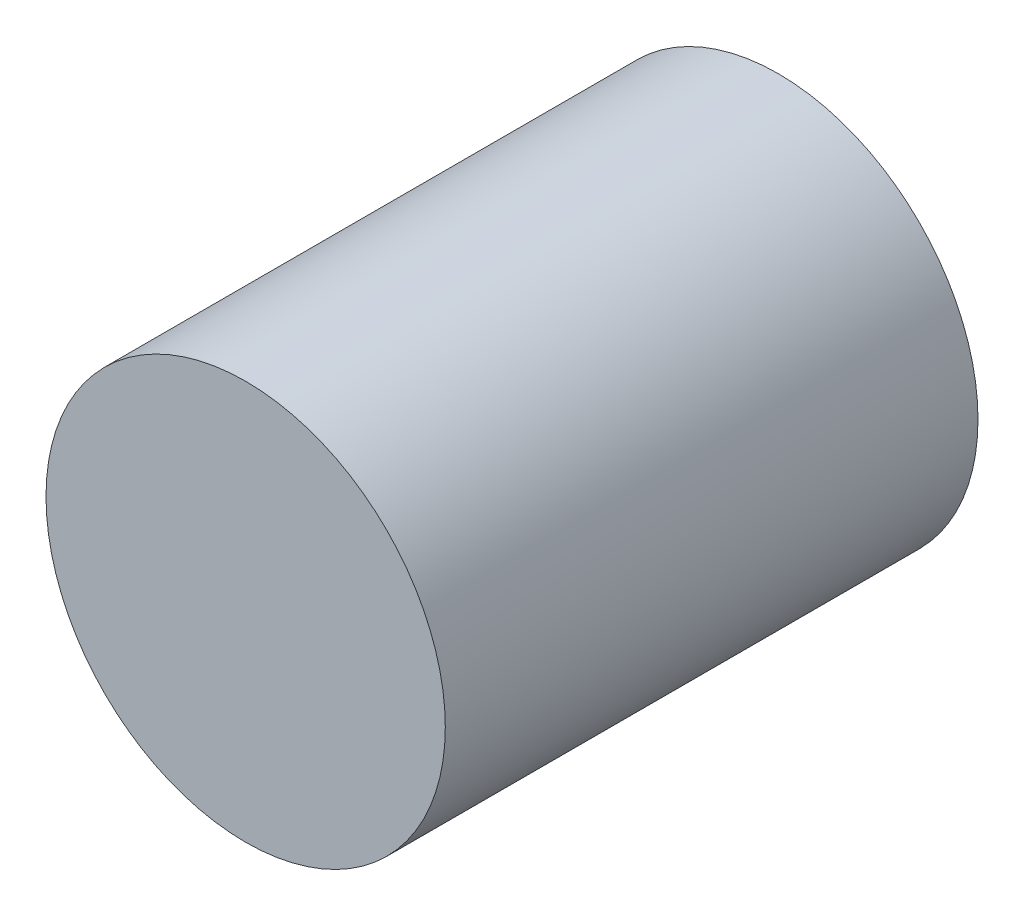
ISO-10303-21;
HEADER;
FILE_DESCRIPTION(('STEP AP214'),'2;1');
FILE_NAME('part.step','',(''),(''),'','','');
FILE_SCHEMA(('AUTOMOTIVE_DESIGN { 1 0 10303 214 1 1 1 1 }'));
ENDSEC;
DATA;
#1=APPLICATION_CONTEXT('core data for automotive mechanical design processes');
#2=APPLICATION_PROTOCOL_DEFINITION('international standard','automotive_design',2000,#1);
#3=PRODUCT_CONTEXT('',#1,'mechanical');
#4=PRODUCT('Part','Part','',(#3));
#5=PRODUCT_RELATED_PRODUCT_CATEGORY('part','',(#4));
#6=PRODUCT_DEFINITION_FORMATION('','',#4);
#7=PRODUCT_DEFINITION_CONTEXT('part definition',#1,'design');
#8=PRODUCT_DEFINITION('design','',#6,#7);
#9=PRODUCT_DEFINITION_SHAPE('','',#8);
#10=(LENGTH_UNIT() NAMED_UNIT(*) SI_UNIT(.MILLI.,.METRE.));
#11=(NAMED_UNIT(*) PLANE_ANGLE_UNIT() SI_UNIT($,.RADIAN.));
#12=(NAMED_UNIT(*) SI_UNIT($,.STERADIAN.) SOLID_ANGLE_UNIT());
#13=UNCERTAINTY_MEASURE_WITH_UNIT(LENGTH_MEASURE(1.E-05),#10,'distance_accuracy_value','');
#14=(GEOMETRIC_REPRESENTATION_CONTEXT(3) GLOBAL_UNCERTAINTY_ASSIGNED_CONTEXT((#13)) GLOBAL_UNIT_ASSIGNED_CONTEXT((#10,
#11,#12)) REPRESENTATION_CONTEXT('',''));
#15=CARTESIAN_POINT('',(0.,0.,0.));
#16=DIRECTION('',(0.,0.,1.));
#17=DIRECTION('',(1.,0.,0.));
#18=AXIS2_PLACEMENT_3D('',#15,#16,#17);
#19=CARTESIAN_POINT('',(0.,0.,12.7));
#20=DIRECTION('',(0.,0.,-1.));
#21=DIRECTION('',(-1.,0.,0.));
#22=AXIS2_PLACEMENT_3D('',#19,#20,#21);
#23=CYLINDRICAL_SURFACE('',#22,4.76);
#24=CARTESIAN_POINT('',(0.,0.,12.7));
#25=DIRECTION('',(0.,0.,1.));
#26=DIRECTION('',(1.,0.,0.));
#27=AXIS2_PLACEMENT_3D('',#24,#25,#26);
#28=CIRCLE('',#27,4.76);
#29=CARTESIAN_POINT('',(4.76,0.,12.7));
#30=VERTEX_POINT('',#29);
#31=EDGE_CURVE('E10',#30,#30,#28,.T.);
#32=ORIENTED_EDGE('',*,*,#31,.F.);
#33=EDGE_LOOP('',(#32));
#34=FACE_BOUND('',#33,.T.);
#35=CARTESIAN_POINT('',(0.,0.,0.));
#36=DIRECTION('',(0.,0.,1.));
#37=DIRECTION('',(1.,0.,0.));
#38=AXIS2_PLACEMENT_3D('',#35,#36,#37);
#39=CIRCLE('',#38,4.76);
#40=CARTESIAN_POINT('',(4.76,0.,0.));
#41=VERTEX_POINT('',#40);
#42=EDGE_CURVE('E42',#41,#41,#39,.T.);
#43=ORIENTED_EDGE('',*,*,#42,.T.);
#44=EDGE_LOOP('',(#43));
#45=FACE_BOUND('',#44,.T.);
#46=ADVANCED_FACE('F39',(#34,#45),#23,.T.);
#47=CARTESIAN_POINT('',(0.,0.,12.7));
#48=DIRECTION('',(0.,0.,1.));
#49=DIRECTION('',(1.,0.,0.));
#50=AXIS2_PLACEMENT_3D('',#47,#48,#49);
#51=PLANE('',#50);
#52=ORIENTED_EDGE('',*,*,#31,.T.);
#53=EDGE_LOOP('',(#52));
#54=FACE_BOUND('',#53,.T.);
#55=ADVANCED_FACE('F56',(#54),#51,.T.);
#56=CARTESIAN_POINT('',(0.,0.,0.));
#57=DIRECTION('',(0.,0.,1.));
#58=DIRECTION('',(1.,0.,0.));
#59=AXIS2_PLACEMENT_3D('',#56,#57,#58);
#60=PLANE('',#59);
#61=ORIENTED_EDGE('',*,*,#42,.F.);
#62=EDGE_LOOP('',(#61));
#63=FACE_BOUND('',#62,.T.);
#64=ADVANCED_FACE('F54',(#63),#60,.F.);
#65=CLOSED_SHELL('',(#46,#55,#64));
#66=MANIFOLD_SOLID_BREP('B2',#65);
#67=ADVANCED_BREP_SHAPE_REPRESENTATION('',(#18,#66),#14);
#68=SHAPE_DEFINITION_REPRESENTATION(#9,#67);
ENDSEC;
END-ISO-10303-21;
